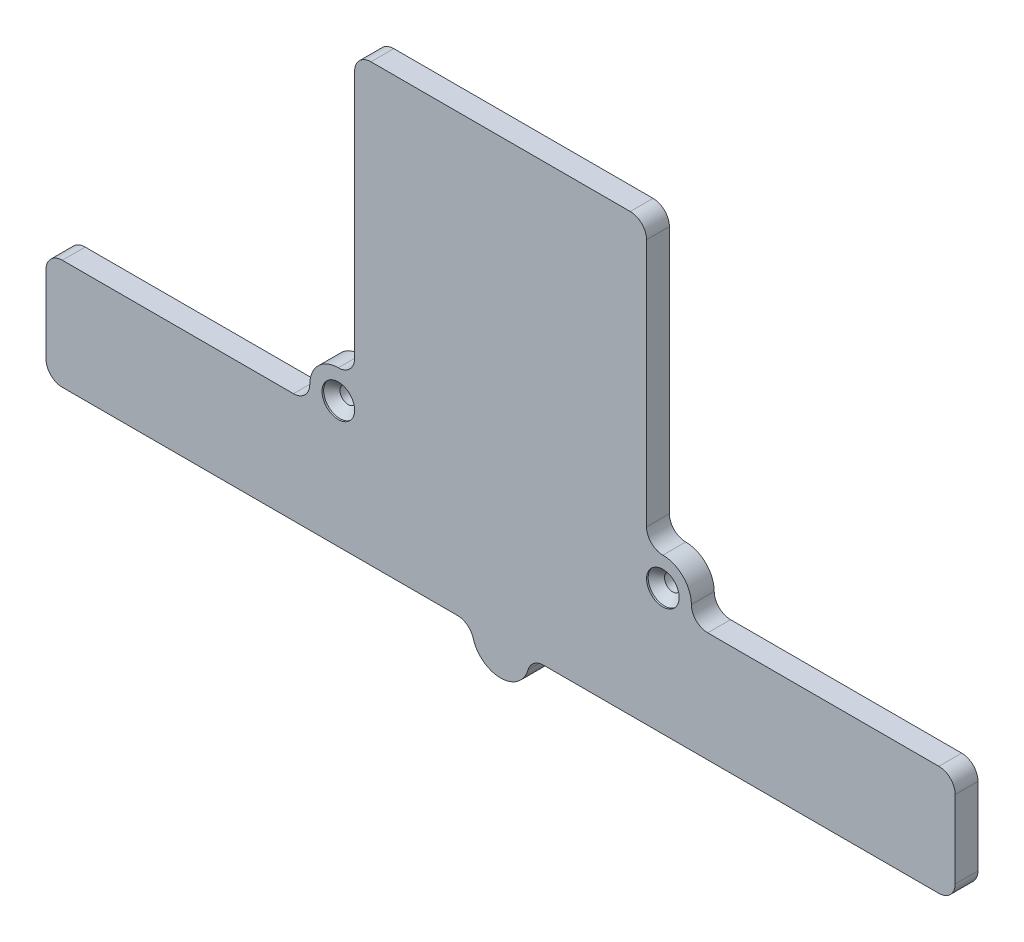
ISO-10303-21;
HEADER;
FILE_DESCRIPTION(('STEP AP214'),'2;1');
FILE_NAME('part.step','',(''),(''),'','','');
FILE_SCHEMA(('AUTOMOTIVE_DESIGN { 1 0 10303 214 1 1 1 1 }'));
ENDSEC;
DATA;
#1=APPLICATION_CONTEXT('core data for automotive mechanical design processes');
#2=APPLICATION_PROTOCOL_DEFINITION('international standard','automotive_design',2000,#1);
#3=PRODUCT_CONTEXT('',#1,'mechanical');
#4=PRODUCT('Part','Part','',(#3));
#5=PRODUCT_RELATED_PRODUCT_CATEGORY('part','',(#4));
#6=PRODUCT_DEFINITION_FORMATION('','',#4);
#7=PRODUCT_DEFINITION_CONTEXT('part definition',#1,'design');
#8=PRODUCT_DEFINITION('design','',#6,#7);
#9=PRODUCT_DEFINITION_SHAPE('','',#8);
#10=(LENGTH_UNIT() NAMED_UNIT(*) SI_UNIT(.MILLI.,.METRE.));
#11=(NAMED_UNIT(*) PLANE_ANGLE_UNIT() SI_UNIT($,.RADIAN.));
#12=(NAMED_UNIT(*) SI_UNIT($,.STERADIAN.) SOLID_ANGLE_UNIT());
#13=UNCERTAINTY_MEASURE_WITH_UNIT(LENGTH_MEASURE(1.E-05),#10,'distance_accuracy_value','');
#14=(GEOMETRIC_REPRESENTATION_CONTEXT(3) GLOBAL_UNCERTAINTY_ASSIGNED_CONTEXT((#13)) GLOBAL_UNIT_ASSIGNED_CONTEXT((#10,
#11,#12)) REPRESENTATION_CONTEXT('',''));
#15=CARTESIAN_POINT('',(0.,0.,0.));
#16=DIRECTION('',(0.,0.,1.));
#17=DIRECTION('',(1.,0.,0.));
#18=AXIS2_PLACEMENT_3D('',#15,#16,#17);
#19=CARTESIAN_POINT('',(-53.75,-24.75,2.8));
#20=DIRECTION('',(0.,0.,-1.));
#21=DIRECTION('',(-1.,0.,0.));
#22=AXIS2_PLACEMENT_3D('',#19,#20,#21);
#23=CYLINDRICAL_SURFACE('',#22,2.);
#24=CARTESIAN_POINT('',(-53.75,-24.75,0.));
#25=DIRECTION('',(0.,0.,1.));
#26=DIRECTION('',(1.,0.,0.));
#27=AXIS2_PLACEMENT_3D('',#24,#25,#26);
#28=CIRCLE('',#27,2.);
#29=CARTESIAN_POINT('',(-55.75,-24.75,0.));
#30=VERTEX_POINT('',#29);
#31=CARTESIAN_POINT('',(-53.75,-26.75,0.));
#32=VERTEX_POINT('',#31);
#33=EDGE_CURVE('E238',#30,#32,#28,.T.);
#34=ORIENTED_EDGE('',*,*,#33,.T.);
#35=DIRECTION('',(0.,0.,-1.));
#36=VECTOR('',#35,1.);
#37=CARTESIAN_POINT('',(-53.75,-26.75,2.8));
#38=LINE('',#37,#36);
#39=CARTESIAN_POINT('',(-53.75,-26.75,2.8));
#40=VERTEX_POINT('',#39);
#41=EDGE_CURVE('E12',#40,#32,#38,.T.);
#42=ORIENTED_EDGE('',*,*,#41,.F.);
#43=CARTESIAN_POINT('',(-53.75,-24.75,2.8));
#44=DIRECTION('',(0.,0.,1.));
#45=DIRECTION('',(1.,0.,0.));
#46=AXIS2_PLACEMENT_3D('',#43,#44,#45);
#47=CIRCLE('',#46,2.);
#48=CARTESIAN_POINT('',(-55.75,-24.75,2.8));
#49=VERTEX_POINT('',#48);
#50=EDGE_CURVE('E287',#49,#40,#47,.T.);
#51=ORIENTED_EDGE('',*,*,#50,.F.);
#52=DIRECTION('',(0.,0.,-1.));
#53=VECTOR('',#52,1.);
#54=CARTESIAN_POINT('',(-55.75,-24.75,2.8));
#55=LINE('',#54,#53);
#56=EDGE_CURVE('E234',#49,#30,#55,.T.);
#57=ORIENTED_EDGE('',*,*,#56,.T.);
#58=EDGE_LOOP('',(#34,#42,#51,#57));
#59=FACE_BOUND('',#58,.T.);
#60=ADVANCED_FACE('F45',(#59),#23,.T.);
#61=CARTESIAN_POINT('',(-53.75,-26.75,2.8));
#62=DIRECTION('',(0.,1.,0.));
#63=DIRECTION('',(0.,0.,1.));
#64=AXIS2_PLACEMENT_3D('',#61,#62,#63);
#65=PLANE('',#64);
#66=DIRECTION('',(1.,0.,0.));
#67=VECTOR('',#66,1.);
#68=CARTESIAN_POINT('',(-53.75,-26.75,0.));
#69=LINE('',#68,#67);
#70=CARTESIAN_POINT('',(-5.29150262212917,-26.75,0.));
#71=VERTEX_POINT('',#70);
#72=EDGE_CURVE('E240',#32,#71,#69,.T.);
#73=ORIENTED_EDGE('',*,*,#72,.T.);
#74=DIRECTION('',(0.,0.,-1.));
#75=VECTOR('',#74,1.);
#76=CARTESIAN_POINT('',(-5.29150262212917,-26.75,2.8));
#77=LINE('',#76,#75);
#78=CARTESIAN_POINT('',(-5.29150262212917,-26.75,2.8));
#79=VERTEX_POINT('',#78);
#80=EDGE_CURVE('E53',#79,#71,#77,.T.);
#81=ORIENTED_EDGE('',*,*,#80,.F.);
#82=DIRECTION('',(1.,0.,0.));
#83=VECTOR('',#82,1.);
#84=CARTESIAN_POINT('',(-53.75,-26.75,2.8));
#85=LINE('',#84,#83);
#86=EDGE_CURVE('E152',#40,#79,#85,.T.);
#87=ORIENTED_EDGE('',*,*,#86,.F.);
#88=ORIENTED_EDGE('',*,*,#41,.T.);
#89=EDGE_LOOP('',(#73,#81,#87,#88));
#90=FACE_BOUND('',#89,.T.);
#91=ADVANCED_FACE('F426',(#90),#65,.F.);
#92=CARTESIAN_POINT('',(-5.29150262212917,-28.75,2.8));
#93=DIRECTION('',(0.,0.,-1.));
#94=DIRECTION('',(-1.,0.,0.));
#95=AXIS2_PLACEMENT_3D('',#92,#93,#94);
#96=CYLINDRICAL_SURFACE('',#95,2.);
#97=CARTESIAN_POINT('',(-5.29150262212917,-28.75,0.));
#98=DIRECTION('',(0.,0.,-1.));
#99=DIRECTION('',(1.,0.,0.));
#100=AXIS2_PLACEMENT_3D('',#97,#98,#99);
#101=CIRCLE('',#100,2.);
#102=CARTESIAN_POINT('',(-3.36731985044583,-28.2045454545455,0.));
#103=VERTEX_POINT('',#102);
#104=EDGE_CURVE('E245',#71,#103,#101,.T.);
#105=ORIENTED_EDGE('',*,*,#104,.T.);
#106=DIRECTION('',(0.,0.,-1.));
#107=VECTOR('',#106,1.);
#108=CARTESIAN_POINT('',(-3.36731985044583,-28.2045454545455,2.8));
#109=LINE('',#108,#107);
#110=CARTESIAN_POINT('',(-3.36731985044583,-28.2045454545455,2.8));
#111=VERTEX_POINT('',#110);
#112=EDGE_CURVE('E342',#111,#103,#109,.T.);
#113=ORIENTED_EDGE('',*,*,#112,.F.);
#114=CARTESIAN_POINT('',(-5.29150262212917,-28.75,2.8));
#115=DIRECTION('',(0.,0.,-1.));
#116=DIRECTION('',(1.,0.,0.));
#117=AXIS2_PLACEMENT_3D('',#114,#115,#116);
#118=CIRCLE('',#117,2.);
#119=EDGE_CURVE('E350',#79,#111,#118,.T.);
#120=ORIENTED_EDGE('',*,*,#119,.F.);
#121=ORIENTED_EDGE('',*,*,#80,.T.);
#122=EDGE_LOOP('',(#105,#113,#120,#121));
#123=FACE_BOUND('',#122,.T.);
#124=ADVANCED_FACE('F348',(#123),#96,.F.);
#125=CARTESIAN_POINT('',(0.,-27.25,2.8));
#126=DIRECTION('',(0.,0.,-1.));
#127=DIRECTION('',(-1.,0.,0.));
#128=AXIS2_PLACEMENT_3D('',#125,#126,#127);
#129=CYLINDRICAL_SURFACE('',#128,3.5);
#130=CARTESIAN_POINT('',(0.,-27.25,0.));
#131=DIRECTION('',(0.,0.,1.));
#132=DIRECTION('',(1.,0.,0.));
#133=AXIS2_PLACEMENT_3D('',#130,#131,#132);
#134=CIRCLE('',#133,3.5);
#135=CARTESIAN_POINT('',(3.36731985044585,-28.2045454545455,0.));
#136=VERTEX_POINT('',#135);
#137=EDGE_CURVE('E248',#103,#136,#134,.T.);
#138=ORIENTED_EDGE('',*,*,#137,.T.);
#139=DIRECTION('',(0.,0.,-1.));
#140=VECTOR('',#139,1.);
#141=CARTESIAN_POINT('',(3.36731985044585,-28.2045454545455,2.8));
#142=LINE('',#141,#140);
#143=CARTESIAN_POINT('',(3.36731985044585,-28.2045454545455,2.8));
#144=VERTEX_POINT('',#143);
#145=EDGE_CURVE('E339',#144,#136,#142,.T.);
#146=ORIENTED_EDGE('',*,*,#145,.F.);
#147=CARTESIAN_POINT('',(0.,-27.25,2.8));
#148=DIRECTION('',(0.,0.,1.));
#149=DIRECTION('',(1.,0.,0.));
#150=AXIS2_PLACEMENT_3D('',#147,#148,#149);
#151=CIRCLE('',#150,3.5);
#152=EDGE_CURVE('E368',#111,#144,#151,.T.);
#153=ORIENTED_EDGE('',*,*,#152,.F.);
#154=ORIENTED_EDGE('',*,*,#112,.T.);
#155=EDGE_LOOP('',(#138,#146,#153,#154));
#156=FACE_BOUND('',#155,.T.);
#157=ADVANCED_FACE('F359',(#156),#129,.T.);
#158=CARTESIAN_POINT('',(5.29150262212919,-28.75,2.8));
#159=DIRECTION('',(0.,0.,-1.));
#160=DIRECTION('',(-1.,0.,0.));
#161=AXIS2_PLACEMENT_3D('',#158,#159,#160);
#162=CYLINDRICAL_SURFACE('',#161,2.);
#163=CARTESIAN_POINT('',(5.29150262212919,-28.75,0.));
#164=DIRECTION('',(0.,0.,-1.));
#165=DIRECTION('',(1.,0.,0.));
#166=AXIS2_PLACEMENT_3D('',#163,#164,#165);
#167=CIRCLE('',#166,2.);
#168=CARTESIAN_POINT('',(5.29150262212919,-26.75,0.));
#169=VERTEX_POINT('',#168);
#170=EDGE_CURVE('E250',#136,#169,#167,.T.);
#171=ORIENTED_EDGE('',*,*,#170,.T.);
#172=DIRECTION('',(0.,0.,-1.));
#173=VECTOR('',#172,1.);
#174=CARTESIAN_POINT('',(5.29150262212919,-26.75,2.8));
#175=LINE('',#174,#173);
#176=CARTESIAN_POINT('',(5.29150262212919,-26.75,2.8));
#177=VERTEX_POINT('',#176);
#178=EDGE_CURVE('E336',#177,#169,#175,.T.);
#179=ORIENTED_EDGE('',*,*,#178,.F.);
#180=CARTESIAN_POINT('',(5.29150262212919,-28.75,2.8));
#181=DIRECTION('',(0.,0.,-1.));
#182=DIRECTION('',(1.,0.,0.));
#183=AXIS2_PLACEMENT_3D('',#180,#181,#182);
#184=CIRCLE('',#183,2.);
#185=EDGE_CURVE('E365',#144,#177,#184,.T.);
#186=ORIENTED_EDGE('',*,*,#185,.F.);
#187=ORIENTED_EDGE('',*,*,#145,.T.);
#188=EDGE_LOOP('',(#171,#179,#186,#187));
#189=FACE_BOUND('',#188,.T.);
#190=ADVANCED_FACE('F363',(#189),#162,.F.);
#191=CARTESIAN_POINT('',(5.29150262212919,-26.75,2.8));
#192=DIRECTION('',(0.,1.,0.));
#193=DIRECTION('',(0.,0.,1.));
#194=AXIS2_PLACEMENT_3D('',#191,#192,#193);
#195=PLANE('',#194);
#196=DIRECTION('',(1.,0.,0.));
#197=VECTOR('',#196,1.);
#198=CARTESIAN_POINT('',(5.29150262212919,-26.75,0.));
#199=LINE('',#198,#197);
#200=CARTESIAN_POINT('',(53.75,-26.75,0.));
#201=VERTEX_POINT('',#200);
#202=EDGE_CURVE('E252',#169,#201,#199,.T.);
#203=ORIENTED_EDGE('',*,*,#202,.T.);
#204=DIRECTION('',(0.,0.,-1.));
#205=VECTOR('',#204,1.);
#206=CARTESIAN_POINT('',(53.75,-26.75,2.8));
#207=LINE('',#206,#205);
#208=CARTESIAN_POINT('',(53.75,-26.75,2.8));
#209=VERTEX_POINT('',#208);
#210=EDGE_CURVE('E333',#209,#201,#207,.T.);
#211=ORIENTED_EDGE('',*,*,#210,.F.);
#212=DIRECTION('',(1.,0.,0.));
#213=VECTOR('',#212,1.);
#214=CARTESIAN_POINT('',(5.29150262212919,-26.75,2.8));
#215=LINE('',#214,#213);
#216=EDGE_CURVE('E367',#177,#209,#215,.T.);
#217=ORIENTED_EDGE('',*,*,#216,.F.);
#218=ORIENTED_EDGE('',*,*,#178,.T.);
#219=EDGE_LOOP('',(#203,#211,#217,#218));
#220=FACE_BOUND('',#219,.T.);
#221=ADVANCED_FACE('F440',(#220),#195,.F.);
#222=CARTESIAN_POINT('',(53.75,-24.75,2.8));
#223=DIRECTION('',(0.,0.,-1.));
#224=DIRECTION('',(-1.,0.,0.));
#225=AXIS2_PLACEMENT_3D('',#222,#223,#224);
#226=CYLINDRICAL_SURFACE('',#225,2.);
#227=CARTESIAN_POINT('',(53.75,-24.75,0.));
#228=DIRECTION('',(0.,0.,1.));
#229=DIRECTION('',(1.,0.,0.));
#230=AXIS2_PLACEMENT_3D('',#227,#228,#229);
#231=CIRCLE('',#230,2.);
#232=CARTESIAN_POINT('',(55.75,-24.75,0.));
#233=VERTEX_POINT('',#232);
#234=EDGE_CURVE('E254',#201,#233,#231,.T.);
#235=ORIENTED_EDGE('',*,*,#234,.T.);
#236=DIRECTION('',(0.,0.,-1.));
#237=VECTOR('',#236,1.);
#238=CARTESIAN_POINT('',(55.75,-24.75,2.8));
#239=LINE('',#238,#237);
#240=CARTESIAN_POINT('',(55.75,-24.75,2.8));
#241=VERTEX_POINT('',#240);
#242=EDGE_CURVE('E330',#241,#233,#239,.T.);
#243=ORIENTED_EDGE('',*,*,#242,.F.);
#244=CARTESIAN_POINT('',(53.75,-24.75,2.8));
#245=DIRECTION('',(0.,0.,1.));
#246=DIRECTION('',(1.,0.,0.));
#247=AXIS2_PLACEMENT_3D('',#244,#245,#246);
#248=CIRCLE('',#247,2.);
#249=EDGE_CURVE('E370',#209,#241,#248,.T.);
#250=ORIENTED_EDGE('',*,*,#249,.F.);
#251=ORIENTED_EDGE('',*,*,#210,.T.);
#252=EDGE_LOOP('',(#235,#243,#250,#251));
#253=FACE_BOUND('',#252,.T.);
#254=ADVANCED_FACE('F443',(#253),#226,.T.);
#255=CARTESIAN_POINT('',(55.75,-24.75,2.8));
#256=DIRECTION('',(-1.,0.,0.));
#257=DIRECTION('',(0.,0.,1.));
#258=AXIS2_PLACEMENT_3D('',#255,#256,#257);
#259=PLANE('',#258);
#260=DIRECTION('',(0.,1.,0.));
#261=VECTOR('',#260,1.);
#262=CARTESIAN_POINT('',(55.75,-24.75,0.));
#263=LINE('',#262,#261);
#264=CARTESIAN_POINT('',(55.75,-15.25,0.));
#265=VERTEX_POINT('',#264);
#266=EDGE_CURVE('E256',#233,#265,#263,.T.);
#267=ORIENTED_EDGE('',*,*,#266,.T.);
#268=DIRECTION('',(0.,0.,-1.));
#269=VECTOR('',#268,1.);
#270=CARTESIAN_POINT('',(55.75,-15.25,2.8));
#271=LINE('',#270,#269);
#272=CARTESIAN_POINT('',(55.75,-15.25,2.8));
#273=VERTEX_POINT('',#272);
#274=EDGE_CURVE('E327',#273,#265,#271,.T.);
#275=ORIENTED_EDGE('',*,*,#274,.F.);
#276=DIRECTION('',(0.,1.,0.));
#277=VECTOR('',#276,1.);
#278=CARTESIAN_POINT('',(55.75,-24.75,2.8));
#279=LINE('',#278,#277);
#280=EDGE_CURVE('E376',#241,#273,#279,.T.);
#281=ORIENTED_EDGE('',*,*,#280,.F.);
#282=ORIENTED_EDGE('',*,*,#242,.T.);
#283=EDGE_LOOP('',(#267,#275,#281,#282));
#284=FACE_BOUND('',#283,.T.);
#285=ADVANCED_FACE('F447',(#284),#259,.F.);
#286=CARTESIAN_POINT('',(53.75,-15.25,2.8));
#287=DIRECTION('',(0.,0.,-1.));
#288=DIRECTION('',(-1.,0.,0.));
#289=AXIS2_PLACEMENT_3D('',#286,#287,#288);
#290=CYLINDRICAL_SURFACE('',#289,2.);
#291=CARTESIAN_POINT('',(53.75,-15.25,0.));
#292=DIRECTION('',(0.,0.,1.));
#293=DIRECTION('',(1.,0.,0.));
#294=AXIS2_PLACEMENT_3D('',#291,#292,#293);
#295=CIRCLE('',#294,2.);
#296=CARTESIAN_POINT('',(53.75,-13.25,0.));
#297=VERTEX_POINT('',#296);
#298=EDGE_CURVE('E258',#265,#297,#295,.T.);
#299=ORIENTED_EDGE('',*,*,#298,.T.);
#300=DIRECTION('',(0.,0.,-1.));
#301=VECTOR('',#300,1.);
#302=CARTESIAN_POINT('',(53.75,-13.25,2.8));
#303=LINE('',#302,#301);
#304=CARTESIAN_POINT('',(53.75,-13.25,2.8));
#305=VERTEX_POINT('',#304);
#306=EDGE_CURVE('E324',#305,#297,#303,.T.);
#307=ORIENTED_EDGE('',*,*,#306,.F.);
#308=CARTESIAN_POINT('',(53.75,-15.25,2.8));
#309=DIRECTION('',(0.,0.,1.));
#310=DIRECTION('',(1.,0.,0.));
#311=AXIS2_PLACEMENT_3D('',#308,#309,#310);
#312=CIRCLE('',#311,2.);
#313=EDGE_CURVE('E378',#273,#305,#312,.T.);
#314=ORIENTED_EDGE('',*,*,#313,.F.);
#315=ORIENTED_EDGE('',*,*,#274,.T.);
#316=EDGE_LOOP('',(#299,#307,#314,#315));
#317=FACE_BOUND('',#316,.T.);
#318=ADVANCED_FACE('F451',(#317),#290,.T.);
#319=CARTESIAN_POINT('',(53.75,-13.25,2.8));
#320=DIRECTION('',(0.,-1.,0.));
#321=DIRECTION('',(1.,0.,0.));
#322=AXIS2_PLACEMENT_3D('',#319,#320,#321);
#323=PLANE('',#322);
#324=DIRECTION('',(-1.,0.,0.));
#325=VECTOR('',#324,1.);
#326=CARTESIAN_POINT('',(53.75,-13.25,0.));
#327=LINE('',#326,#325);
#328=CARTESIAN_POINT('',(25.4,-13.25,0.));
#329=VERTEX_POINT('',#328);
#330=EDGE_CURVE('E260',#297,#329,#327,.T.);
#331=ORIENTED_EDGE('',*,*,#330,.T.);
#332=DIRECTION('',(0.,0.,-1.));
#333=VECTOR('',#332,1.);
#334=CARTESIAN_POINT('',(25.4,-13.25,2.8));
#335=LINE('',#334,#333);
#336=CARTESIAN_POINT('',(25.4,-13.25,2.8));
#337=VERTEX_POINT('',#336);
#338=EDGE_CURVE('E321',#337,#329,#335,.T.);
#339=ORIENTED_EDGE('',*,*,#338,.F.);
#340=DIRECTION('',(-1.,0.,0.));
#341=VECTOR('',#340,1.);
#342=CARTESIAN_POINT('',(53.75,-13.25,2.8));
#343=LINE('',#342,#341);
#344=EDGE_CURVE('E380',#305,#337,#343,.T.);
#345=ORIENTED_EDGE('',*,*,#344,.F.);
#346=ORIENTED_EDGE('',*,*,#306,.T.);
#347=EDGE_LOOP('',(#331,#339,#345,#346));
#348=FACE_BOUND('',#347,.T.);
#349=ADVANCED_FACE('F455',(#348),#323,.F.);
#350=CARTESIAN_POINT('',(25.4,-11.25,2.8));
#351=DIRECTION('',(0.,0.,-1.));
#352=DIRECTION('',(-1.,0.,0.));
#353=AXIS2_PLACEMENT_3D('',#350,#351,#352);
#354=CYLINDRICAL_SURFACE('',#353,2.);
#355=CARTESIAN_POINT('',(25.4,-11.25,0.));
#356=DIRECTION('',(0.,0.,-1.));
#357=DIRECTION('',(1.,0.,0.));
#358=AXIS2_PLACEMENT_3D('',#355,#356,#357);
#359=CIRCLE('',#358,2.);
#360=CARTESIAN_POINT('',(23.4,-11.25,0.));
#361=VERTEX_POINT('',#360);
#362=EDGE_CURVE('E262',#329,#361,#359,.T.);
#363=ORIENTED_EDGE('',*,*,#362,.T.);
#364=DIRECTION('',(0.,0.,-1.));
#365=VECTOR('',#364,1.);
#366=CARTESIAN_POINT('',(23.4,-11.25,2.8));
#367=LINE('',#366,#365);
#368=CARTESIAN_POINT('',(23.4,-11.25,2.8));
#369=VERTEX_POINT('',#368);
#370=EDGE_CURVE('E318',#369,#361,#367,.T.);
#371=ORIENTED_EDGE('',*,*,#370,.F.);
#372=CARTESIAN_POINT('',(25.4,-11.25,2.8));
#373=DIRECTION('',(0.,0.,-1.));
#374=DIRECTION('',(1.,0.,0.));
#375=AXIS2_PLACEMENT_3D('',#372,#373,#374);
#376=CIRCLE('',#375,2.);
#377=EDGE_CURVE('E382',#337,#369,#376,.T.);
#378=ORIENTED_EDGE('',*,*,#377,.F.);
#379=ORIENTED_EDGE('',*,*,#338,.T.);
#380=EDGE_LOOP('',(#363,#371,#378,#379));
#381=FACE_BOUND('',#380,.T.);
#382=ADVANCED_FACE('F459',(#381),#354,.F.);
#383=CARTESIAN_POINT('',(19.9,-11.25,2.8));
#384=DIRECTION('',(0.,0.,-1.));
#385=DIRECTION('',(-1.,0.,0.));
#386=AXIS2_PLACEMENT_3D('',#383,#384,#385);
#387=CYLINDRICAL_SURFACE('',#386,3.50000000000001);
#388=CARTESIAN_POINT('',(19.9,-11.25,0.));
#389=DIRECTION('',(0.,0.,1.));
#390=DIRECTION('',(1.,0.,0.));
#391=AXIS2_PLACEMENT_3D('',#388,#389,#390);
#392=CIRCLE('',#391,3.50000000000001);
#393=CARTESIAN_POINT('',(19.9,-7.74999999999999,0.));
#394=VERTEX_POINT('',#393);
#395=EDGE_CURVE('E264',#361,#394,#392,.T.);
#396=ORIENTED_EDGE('',*,*,#395,.T.);
#397=DIRECTION('',(0.,0.,-1.));
#398=VECTOR('',#397,1.);
#399=CARTESIAN_POINT('',(19.9,-7.74999999999999,2.8));
#400=LINE('',#399,#398);
#401=CARTESIAN_POINT('',(19.9,-7.74999999999999,2.8));
#402=VERTEX_POINT('',#401);
#403=EDGE_CURVE('E315',#402,#394,#400,.T.);
#404=ORIENTED_EDGE('',*,*,#403,.F.);
#405=CARTESIAN_POINT('',(19.9,-11.25,2.8));
#406=DIRECTION('',(0.,0.,1.));
#407=DIRECTION('',(1.,0.,0.));
#408=AXIS2_PLACEMENT_3D('',#405,#406,#407);
#409=CIRCLE('',#408,3.50000000000001);
#410=EDGE_CURVE('E384',#369,#402,#409,.T.);
#411=ORIENTED_EDGE('',*,*,#410,.F.);
#412=ORIENTED_EDGE('',*,*,#370,.T.);
#413=EDGE_LOOP('',(#396,#404,#411,#412));
#414=FACE_BOUND('',#413,.T.);
#415=ADVANCED_FACE('F463',(#414),#387,.T.);
#416=CARTESIAN_POINT('',(19.9,-5.75,2.8));
#417=DIRECTION('',(0.,0.,-1.));
#418=DIRECTION('',(-1.,0.,0.));
#419=AXIS2_PLACEMENT_3D('',#416,#417,#418);
#420=CYLINDRICAL_SURFACE('',#419,2.);
#421=CARTESIAN_POINT('',(19.9,-5.75,0.));
#422=DIRECTION('',(0.,0.,-1.));
#423=DIRECTION('',(1.,0.,0.));
#424=AXIS2_PLACEMENT_3D('',#421,#422,#423);
#425=CIRCLE('',#424,2.);
#426=CARTESIAN_POINT('',(17.9,-5.75000000000001,0.));
#427=VERTEX_POINT('',#426);
#428=EDGE_CURVE('E266',#394,#427,#425,.T.);
#429=ORIENTED_EDGE('',*,*,#428,.T.);
#430=DIRECTION('',(0.,0.,-1.));
#431=VECTOR('',#430,1.);
#432=CARTESIAN_POINT('',(17.9,-5.75000000000001,2.8));
#433=LINE('',#432,#431);
#434=CARTESIAN_POINT('',(17.9,-5.75000000000001,2.8));
#435=VERTEX_POINT('',#434);
#436=EDGE_CURVE('E312',#435,#427,#433,.T.);
#437=ORIENTED_EDGE('',*,*,#436,.F.);
#438=CARTESIAN_POINT('',(19.9,-5.75,2.8));
#439=DIRECTION('',(0.,0.,-1.));
#440=DIRECTION('',(1.,0.,0.));
#441=AXIS2_PLACEMENT_3D('',#438,#439,#440);
#442=CIRCLE('',#441,2.);
#443=EDGE_CURVE('E386',#402,#435,#442,.T.);
#444=ORIENTED_EDGE('',*,*,#443,.F.);
#445=ORIENTED_EDGE('',*,*,#403,.T.);
#446=EDGE_LOOP('',(#429,#437,#444,#445));
#447=FACE_BOUND('',#446,.T.);
#448=ADVANCED_FACE('F467',(#447),#420,.F.);
#449=CARTESIAN_POINT('',(17.9,-5.75000000000001,2.8));
#450=DIRECTION('',(-1.,0.,0.));
#451=DIRECTION('',(0.,0.,1.));
#452=AXIS2_PLACEMENT_3D('',#449,#450,#451);
#453=PLANE('',#452);
#454=DIRECTION('',(0.,1.,0.));
#455=VECTOR('',#454,1.);
#456=CARTESIAN_POINT('',(17.9,-5.75000000000001,0.));
#457=LINE('',#456,#455);
#458=CARTESIAN_POINT('',(17.9,24.75,0.));
#459=VERTEX_POINT('',#458);
#460=EDGE_CURVE('E268',#427,#459,#457,.T.);
#461=ORIENTED_EDGE('',*,*,#460,.T.);
#462=DIRECTION('',(0.,0.,-1.));
#463=VECTOR('',#462,1.);
#464=CARTESIAN_POINT('',(17.9,24.75,2.8));
#465=LINE('',#464,#463);
#466=CARTESIAN_POINT('',(17.9,24.75,2.8));
#467=VERTEX_POINT('',#466);
#468=EDGE_CURVE('E309',#467,#459,#465,.T.);
#469=ORIENTED_EDGE('',*,*,#468,.F.);
#470=DIRECTION('',(0.,1.,0.));
#471=VECTOR('',#470,1.);
#472=CARTESIAN_POINT('',(17.9,-5.75000000000001,2.8));
#473=LINE('',#472,#471);
#474=EDGE_CURVE('E388',#435,#467,#473,.T.);
#475=ORIENTED_EDGE('',*,*,#474,.F.);
#476=ORIENTED_EDGE('',*,*,#436,.T.);
#477=EDGE_LOOP('',(#461,#469,#475,#476));
#478=FACE_BOUND('',#477,.T.);
#479=ADVANCED_FACE('F471',(#478),#453,.F.);
#480=CARTESIAN_POINT('',(15.9,24.75,2.8));
#481=DIRECTION('',(0.,0.,-1.));
#482=DIRECTION('',(-1.,0.,0.));
#483=AXIS2_PLACEMENT_3D('',#480,#481,#482);
#484=CYLINDRICAL_SURFACE('',#483,2.);
#485=CARTESIAN_POINT('',(15.9,24.75,0.));
#486=DIRECTION('',(0.,0.,1.));
#487=DIRECTION('',(1.,0.,0.));
#488=AXIS2_PLACEMENT_3D('',#485,#486,#487);
#489=CIRCLE('',#488,2.);
#490=CARTESIAN_POINT('',(15.9,26.75,0.));
#491=VERTEX_POINT('',#490);
#492=EDGE_CURVE('E270',#459,#491,#489,.T.);
#493=ORIENTED_EDGE('',*,*,#492,.T.);
#494=DIRECTION('',(0.,0.,-1.));
#495=VECTOR('',#494,1.);
#496=CARTESIAN_POINT('',(15.9,26.75,2.8));
#497=LINE('',#496,#495);
#498=CARTESIAN_POINT('',(15.9,26.75,2.8));
#499=VERTEX_POINT('',#498);
#500=EDGE_CURVE('E306',#499,#491,#497,.T.);
#501=ORIENTED_EDGE('',*,*,#500,.F.);
#502=CARTESIAN_POINT('',(15.9,24.75,2.8));
#503=DIRECTION('',(0.,0.,1.));
#504=DIRECTION('',(1.,0.,0.));
#505=AXIS2_PLACEMENT_3D('',#502,#503,#504);
#506=CIRCLE('',#505,2.);
#507=EDGE_CURVE('E390',#467,#499,#506,.T.);
#508=ORIENTED_EDGE('',*,*,#507,.F.);
#509=ORIENTED_EDGE('',*,*,#468,.T.);
#510=EDGE_LOOP('',(#493,#501,#508,#509));
#511=FACE_BOUND('',#510,.T.);
#512=ADVANCED_FACE('F475',(#511),#484,.T.);
#513=CARTESIAN_POINT('',(15.9,26.75,2.8));
#514=DIRECTION('',(0.,-1.,0.));
#515=DIRECTION('',(0.,0.,-1.));
#516=AXIS2_PLACEMENT_3D('',#513,#514,#515);
#517=PLANE('',#516);
#518=DIRECTION('',(-1.,0.,0.));
#519=VECTOR('',#518,1.);
#520=CARTESIAN_POINT('',(15.9,26.75,0.));
#521=LINE('',#520,#519);
#522=CARTESIAN_POINT('',(-15.9,26.75,0.));
#523=VERTEX_POINT('',#522);
#524=EDGE_CURVE('E272',#491,#523,#521,.T.);
#525=ORIENTED_EDGE('',*,*,#524,.T.);
#526=DIRECTION('',(0.,0.,-1.));
#527=VECTOR('',#526,1.);
#528=CARTESIAN_POINT('',(-15.9,26.75,2.8));
#529=LINE('',#528,#527);
#530=CARTESIAN_POINT('',(-15.9,26.75,2.8));
#531=VERTEX_POINT('',#530);
#532=EDGE_CURVE('E303',#531,#523,#529,.T.);
#533=ORIENTED_EDGE('',*,*,#532,.F.);
#534=DIRECTION('',(-1.,0.,0.));
#535=VECTOR('',#534,1.);
#536=CARTESIAN_POINT('',(15.9,26.75,2.8));
#537=LINE('',#536,#535);
#538=EDGE_CURVE('E392',#499,#531,#537,.T.);
#539=ORIENTED_EDGE('',*,*,#538,.F.);
#540=ORIENTED_EDGE('',*,*,#500,.T.);
#541=EDGE_LOOP('',(#525,#533,#539,#540));
#542=FACE_BOUND('',#541,.T.);
#543=ADVANCED_FACE('F479',(#542),#517,.F.);
#544=CARTESIAN_POINT('',(-15.9,24.75,2.8));
#545=DIRECTION('',(0.,0.,-1.));
#546=DIRECTION('',(-1.,0.,0.));
#547=AXIS2_PLACEMENT_3D('',#544,#545,#546);
#548=CYLINDRICAL_SURFACE('',#547,2.);
#549=CARTESIAN_POINT('',(-15.9,24.75,0.));
#550=DIRECTION('',(0.,0.,1.));
#551=DIRECTION('',(1.,0.,0.));
#552=AXIS2_PLACEMENT_3D('',#549,#550,#551);
#553=CIRCLE('',#552,2.);
#554=CARTESIAN_POINT('',(-17.9,24.75,0.));
#555=VERTEX_POINT('',#554);
#556=EDGE_CURVE('E274',#523,#555,#553,.T.);
#557=ORIENTED_EDGE('',*,*,#556,.T.);
#558=DIRECTION('',(0.,0.,-1.));
#559=VECTOR('',#558,1.);
#560=CARTESIAN_POINT('',(-17.9,24.75,2.8));
#561=LINE('',#560,#559);
#562=CARTESIAN_POINT('',(-17.9,24.75,2.8));
#563=VERTEX_POINT('',#562);
#564=EDGE_CURVE('E300',#563,#555,#561,.T.);
#565=ORIENTED_EDGE('',*,*,#564,.F.);
#566=CARTESIAN_POINT('',(-15.9,24.75,2.8));
#567=DIRECTION('',(0.,0.,1.));
#568=DIRECTION('',(1.,0.,0.));
#569=AXIS2_PLACEMENT_3D('',#566,#567,#568);
#570=CIRCLE('',#569,2.);
#571=EDGE_CURVE('E394',#531,#563,#570,.T.);
#572=ORIENTED_EDGE('',*,*,#571,.F.);
#573=ORIENTED_EDGE('',*,*,#532,.T.);
#574=EDGE_LOOP('',(#557,#565,#572,#573));
#575=FACE_BOUND('',#574,.T.);
#576=ADVANCED_FACE('F483',(#575),#548,.T.);
#577=CARTESIAN_POINT('',(-17.9,24.75,2.8));
#578=DIRECTION('',(1.,0.,0.));
#579=DIRECTION('',(0.,0.,-1.));
#580=AXIS2_PLACEMENT_3D('',#577,#578,#579);
#581=PLANE('',#580);
#582=DIRECTION('',(0.,-1.,0.));
#583=VECTOR('',#582,1.);
#584=CARTESIAN_POINT('',(-17.9,24.75,0.));
#585=LINE('',#584,#583);
#586=CARTESIAN_POINT('',(-17.9,-5.75000000000001,0.));
#587=VERTEX_POINT('',#586);
#588=EDGE_CURVE('E276',#555,#587,#585,.T.);
#589=ORIENTED_EDGE('',*,*,#588,.T.);
#590=DIRECTION('',(0.,0.,-1.));
#591=VECTOR('',#590,1.);
#592=CARTESIAN_POINT('',(-17.9,-5.75000000000001,2.8));
#593=LINE('',#592,#591);
#594=CARTESIAN_POINT('',(-17.9,-5.75000000000001,2.8));
#595=VERTEX_POINT('',#594);
#596=EDGE_CURVE('E297',#595,#587,#593,.T.);
#597=ORIENTED_EDGE('',*,*,#596,.F.);
#598=DIRECTION('',(0.,-1.,0.));
#599=VECTOR('',#598,1.);
#600=CARTESIAN_POINT('',(-17.9,24.75,2.8));
#601=LINE('',#600,#599);
#602=EDGE_CURVE('E396',#563,#595,#601,.T.);
#603=ORIENTED_EDGE('',*,*,#602,.F.);
#604=ORIENTED_EDGE('',*,*,#564,.T.);
#605=EDGE_LOOP('',(#589,#597,#603,#604));
#606=FACE_BOUND('',#605,.T.);
#607=ADVANCED_FACE('F487',(#606),#581,.F.);
#608=CARTESIAN_POINT('',(-19.9,-5.75000000000001,2.8));
#609=DIRECTION('',(0.,0.,-1.));
#610=DIRECTION('',(-1.,0.,0.));
#611=AXIS2_PLACEMENT_3D('',#608,#609,#610);
#612=CYLINDRICAL_SURFACE('',#611,2.);
#613=CARTESIAN_POINT('',(-19.9,-5.75000000000001,0.));
#614=DIRECTION('',(0.,0.,-1.));
#615=DIRECTION('',(1.,0.,0.));
#616=AXIS2_PLACEMENT_3D('',#613,#614,#615);
#617=CIRCLE('',#616,2.);
#618=CARTESIAN_POINT('',(-19.9,-7.75000000000001,0.));
#619=VERTEX_POINT('',#618);
#620=EDGE_CURVE('E278',#587,#619,#617,.T.);
#621=ORIENTED_EDGE('',*,*,#620,.T.);
#622=DIRECTION('',(0.,0.,-1.));
#623=VECTOR('',#622,1.);
#624=CARTESIAN_POINT('',(-19.9,-7.75000000000001,2.8));
#625=LINE('',#624,#623);
#626=CARTESIAN_POINT('',(-19.9,-7.75000000000001,2.8));
#627=VERTEX_POINT('',#626);
#628=EDGE_CURVE('E294',#627,#619,#625,.T.);
#629=ORIENTED_EDGE('',*,*,#628,.F.);
#630=CARTESIAN_POINT('',(-19.9,-5.75000000000001,2.8));
#631=DIRECTION('',(0.,0.,-1.));
#632=DIRECTION('',(1.,0.,0.));
#633=AXIS2_PLACEMENT_3D('',#630,#631,#632);
#634=CIRCLE('',#633,2.);
#635=EDGE_CURVE('E398',#595,#627,#634,.T.);
#636=ORIENTED_EDGE('',*,*,#635,.F.);
#637=ORIENTED_EDGE('',*,*,#596,.T.);
#638=EDGE_LOOP('',(#621,#629,#636,#637));
#639=FACE_BOUND('',#638,.T.);
#640=ADVANCED_FACE('F491',(#639),#612,.F.);
#641=CARTESIAN_POINT('',(-19.9,-11.25,2.8));
#642=DIRECTION('',(0.,0.,-1.));
#643=DIRECTION('',(-1.,0.,0.));
#644=AXIS2_PLACEMENT_3D('',#641,#642,#643);
#645=CYLINDRICAL_SURFACE('',#644,3.5);
#646=CARTESIAN_POINT('',(-19.9,-11.25,0.));
#647=DIRECTION('',(0.,0.,1.));
#648=DIRECTION('',(1.,0.,0.));
#649=AXIS2_PLACEMENT_3D('',#646,#647,#648);
#650=CIRCLE('',#649,3.5);
#651=CARTESIAN_POINT('',(-23.4,-11.25,0.));
#652=VERTEX_POINT('',#651);
#653=EDGE_CURVE('E280',#619,#652,#650,.T.);
#654=ORIENTED_EDGE('',*,*,#653,.T.);
#655=DIRECTION('',(0.,0.,-1.));
#656=VECTOR('',#655,1.);
#657=CARTESIAN_POINT('',(-23.4,-11.25,2.8));
#658=LINE('',#657,#656);
#659=CARTESIAN_POINT('',(-23.4,-11.25,2.8));
#660=VERTEX_POINT('',#659);
#661=EDGE_CURVE('E291',#660,#652,#658,.T.);
#662=ORIENTED_EDGE('',*,*,#661,.F.);
#663=CARTESIAN_POINT('',(-19.9,-11.25,2.8));
#664=DIRECTION('',(0.,0.,1.));
#665=DIRECTION('',(1.,0.,0.));
#666=AXIS2_PLACEMENT_3D('',#663,#664,#665);
#667=CIRCLE('',#666,3.5);
#668=EDGE_CURVE('E400',#627,#660,#667,.T.);
#669=ORIENTED_EDGE('',*,*,#668,.F.);
#670=ORIENTED_EDGE('',*,*,#628,.T.);
#671=EDGE_LOOP('',(#654,#662,#669,#670));
#672=FACE_BOUND('',#671,.T.);
#673=ADVANCED_FACE('F406',(#672),#645,.T.);
#674=CARTESIAN_POINT('',(-25.4,-11.25,2.8));
#675=DIRECTION('',(0.,0.,-1.));
#676=DIRECTION('',(-1.,0.,0.));
#677=AXIS2_PLACEMENT_3D('',#674,#675,#676);
#678=CYLINDRICAL_SURFACE('',#677,2.);
#679=CARTESIAN_POINT('',(-25.4,-11.25,0.));
#680=DIRECTION('',(0.,0.,-1.));
#681=DIRECTION('',(1.,0.,0.));
#682=AXIS2_PLACEMENT_3D('',#679,#680,#681);
#683=CIRCLE('',#682,2.);
#684=CARTESIAN_POINT('',(-25.4,-13.25,0.));
#685=VERTEX_POINT('',#684);
#686=EDGE_CURVE('E282',#652,#685,#683,.T.);
#687=ORIENTED_EDGE('',*,*,#686,.T.);
#688=DIRECTION('',(0.,0.,-1.));
#689=VECTOR('',#688,1.);
#690=CARTESIAN_POINT('',(-25.4,-13.25,2.8));
#691=LINE('',#690,#689);
#692=CARTESIAN_POINT('',(-25.4,-13.25,2.8));
#693=VERTEX_POINT('',#692);
#694=EDGE_CURVE('E229',#693,#685,#691,.T.);
#695=ORIENTED_EDGE('',*,*,#694,.F.);
#696=CARTESIAN_POINT('',(-25.4,-11.25,2.8));
#697=DIRECTION('',(0.,0.,-1.));
#698=DIRECTION('',(1.,0.,0.));
#699=AXIS2_PLACEMENT_3D('',#696,#697,#698);
#700=CIRCLE('',#699,2.);
#701=EDGE_CURVE('E220',#660,#693,#700,.T.);
#702=ORIENTED_EDGE('',*,*,#701,.F.);
#703=ORIENTED_EDGE('',*,*,#661,.T.);
#704=EDGE_LOOP('',(#687,#695,#702,#703));
#705=FACE_BOUND('',#704,.T.);
#706=ADVANCED_FACE('F410',(#705),#678,.F.);
#707=CARTESIAN_POINT('',(-25.4,-13.25,2.8));
#708=DIRECTION('',(0.,-1.,0.));
#709=DIRECTION('',(0.,0.,-1.));
#710=AXIS2_PLACEMENT_3D('',#707,#708,#709);
#711=PLANE('',#710);
#712=DIRECTION('',(-1.,0.,0.));
#713=VECTOR('',#712,1.);
#714=CARTESIAN_POINT('',(-25.4,-13.25,0.));
#715=LINE('',#714,#713);
#716=CARTESIAN_POINT('',(-53.75,-13.25,0.));
#717=VERTEX_POINT('',#716);
#718=EDGE_CURVE('E228',#685,#717,#715,.T.);
#719=ORIENTED_EDGE('',*,*,#718,.T.);
#720=DIRECTION('',(0.,0.,-1.));
#721=VECTOR('',#720,1.);
#722=CARTESIAN_POINT('',(-53.75,-13.25,2.8));
#723=LINE('',#722,#721);
#724=CARTESIAN_POINT('',(-53.75,-13.25,2.8));
#725=VERTEX_POINT('',#724);
#726=EDGE_CURVE('E225',#725,#717,#723,.T.);
#727=ORIENTED_EDGE('',*,*,#726,.F.);
#728=DIRECTION('',(-1.,0.,0.));
#729=VECTOR('',#728,1.);
#730=CARTESIAN_POINT('',(-25.4,-13.25,2.8));
#731=LINE('',#730,#729);
#732=EDGE_CURVE('E214',#693,#725,#731,.T.);
#733=ORIENTED_EDGE('',*,*,#732,.F.);
#734=ORIENTED_EDGE('',*,*,#694,.T.);
#735=EDGE_LOOP('',(#719,#727,#733,#734));
#736=FACE_BOUND('',#735,.T.);
#737=ADVANCED_FACE('F226',(#736),#711,.F.);
#738=CARTESIAN_POINT('',(-53.75,-15.25,2.8));
#739=DIRECTION('',(0.,0.,-1.));
#740=DIRECTION('',(-1.,0.,0.));
#741=AXIS2_PLACEMENT_3D('',#738,#739,#740);
#742=CYLINDRICAL_SURFACE('',#741,2.);
#743=CARTESIAN_POINT('',(-53.75,-15.25,0.));
#744=DIRECTION('',(0.,0.,1.));
#745=DIRECTION('',(1.,0.,0.));
#746=AXIS2_PLACEMENT_3D('',#743,#744,#745);
#747=CIRCLE('',#746,2.);
#748=CARTESIAN_POINT('',(-55.75,-15.25,0.));
#749=VERTEX_POINT('',#748);
#750=EDGE_CURVE('E138',#717,#749,#747,.T.);
#751=ORIENTED_EDGE('',*,*,#750,.T.);
#752=DIRECTION('',(0.,0.,-1.));
#753=VECTOR('',#752,1.);
#754=CARTESIAN_POINT('',(-55.75,-15.25,2.8));
#755=LINE('',#754,#753);
#756=CARTESIAN_POINT('',(-55.75,-15.25,2.8));
#757=VERTEX_POINT('',#756);
#758=EDGE_CURVE('E230',#757,#749,#755,.T.);
#759=ORIENTED_EDGE('',*,*,#758,.F.);
#760=CARTESIAN_POINT('',(-53.75,-15.25,2.8));
#761=DIRECTION('',(0.,0.,1.));
#762=DIRECTION('',(1.,0.,0.));
#763=AXIS2_PLACEMENT_3D('',#760,#761,#762);
#764=CIRCLE('',#763,2.);
#765=EDGE_CURVE('E218',#725,#757,#764,.T.);
#766=ORIENTED_EDGE('',*,*,#765,.F.);
#767=ORIENTED_EDGE('',*,*,#726,.T.);
#768=EDGE_LOOP('',(#751,#759,#766,#767));
#769=FACE_BOUND('',#768,.T.);
#770=ADVANCED_FACE('F232',(#769),#742,.T.);
#771=CARTESIAN_POINT('',(-55.75,-15.25,2.8));
#772=DIRECTION('',(1.,0.,0.));
#773=DIRECTION('',(0.,0.,-1.));
#774=AXIS2_PLACEMENT_3D('',#771,#772,#773);
#775=PLANE('',#774);
#776=DIRECTION('',(0.,-1.,0.));
#777=VECTOR('',#776,1.);
#778=CARTESIAN_POINT('',(-55.75,-15.25,0.));
#779=LINE('',#778,#777);
#780=EDGE_CURVE('E144',#749,#30,#779,.T.);
#781=ORIENTED_EDGE('',*,*,#780,.T.);
#782=ORIENTED_EDGE('',*,*,#56,.F.);
#783=DIRECTION('',(0.,-1.,0.));
#784=VECTOR('',#783,1.);
#785=CARTESIAN_POINT('',(-55.75,-15.25,2.8));
#786=LINE('',#785,#784);
#787=EDGE_CURVE('E61',#757,#49,#786,.T.);
#788=ORIENTED_EDGE('',*,*,#787,.F.);
#789=ORIENTED_EDGE('',*,*,#758,.T.);
#790=EDGE_LOOP('',(#781,#782,#788,#789));
#791=FACE_BOUND('',#790,.T.);
#792=ADVANCED_FACE('F414',(#791),#775,.F.);
#793=CARTESIAN_POINT('',(-53.75,-24.75,2.8));
#794=DIRECTION('',(0.,0.,1.));
#795=DIRECTION('',(1.,0.,0.));
#796=AXIS2_PLACEMENT_3D('',#793,#794,#795);
#797=PLANE('',#796);
#798=CARTESIAN_POINT('',(-19.9,-11.25,2.8));
#799=DIRECTION('',(0.,0.,1.));
#800=DIRECTION('',(1.,0.,0.));
#801=AXIS2_PLACEMENT_3D('',#798,#799,#800);
#802=CIRCLE('',#801,2.);
#803=CARTESIAN_POINT('',(-17.9,-11.25,2.8));
#804=VERTEX_POINT('',#803);
#805=EDGE_CURVE('E730',#804,#804,#802,.T.);
#806=ORIENTED_EDGE('',*,*,#805,.F.);
#807=EDGE_LOOP('',(#806));
#808=FACE_BOUND('',#807,.T.);
#809=CARTESIAN_POINT('',(19.9,-11.25,2.8));
#810=DIRECTION('',(0.,0.,1.));
#811=DIRECTION('',(1.,0.,0.));
#812=AXIS2_PLACEMENT_3D('',#809,#810,#811);
#813=CIRCLE('',#812,2.);
#814=CARTESIAN_POINT('',(21.9,-11.25,2.8));
#815=VERTEX_POINT('',#814);
#816=EDGE_CURVE('E737',#815,#815,#813,.T.);
#817=ORIENTED_EDGE('',*,*,#816,.F.);
#818=EDGE_LOOP('',(#817));
#819=FACE_BOUND('',#818,.T.);
#820=ORIENTED_EDGE('',*,*,#50,.T.);
#821=ORIENTED_EDGE('',*,*,#86,.T.);
#822=ORIENTED_EDGE('',*,*,#119,.T.);
#823=ORIENTED_EDGE('',*,*,#152,.T.);
#824=ORIENTED_EDGE('',*,*,#185,.T.);
#825=ORIENTED_EDGE('',*,*,#216,.T.);
#826=ORIENTED_EDGE('',*,*,#249,.T.);
#827=ORIENTED_EDGE('',*,*,#280,.T.);
#828=ORIENTED_EDGE('',*,*,#313,.T.);
#829=ORIENTED_EDGE('',*,*,#344,.T.);
#830=ORIENTED_EDGE('',*,*,#377,.T.);
#831=ORIENTED_EDGE('',*,*,#410,.T.);
#832=ORIENTED_EDGE('',*,*,#443,.T.);
#833=ORIENTED_EDGE('',*,*,#474,.T.);
#834=ORIENTED_EDGE('',*,*,#507,.T.);
#835=ORIENTED_EDGE('',*,*,#538,.T.);
#836=ORIENTED_EDGE('',*,*,#571,.T.);
#837=ORIENTED_EDGE('',*,*,#602,.T.);
#838=ORIENTED_EDGE('',*,*,#635,.T.);
#839=ORIENTED_EDGE('',*,*,#668,.T.);
#840=ORIENTED_EDGE('',*,*,#701,.T.);
#841=ORIENTED_EDGE('',*,*,#732,.T.);
#842=ORIENTED_EDGE('',*,*,#765,.T.);
#843=ORIENTED_EDGE('',*,*,#787,.T.);
#844=EDGE_LOOP('',(#820,#821,#822,#823,#824,#825,#826,#827,#828,#829,#830,#831,#832,#833,#834,
#835,#836,#837,#838,#839,#840,#841,#842,#843));
#845=FACE_BOUND('',#844,.T.);
#846=ADVANCED_FACE('F216',(#808,#819,#845),#797,.T.);
#847=CARTESIAN_POINT('',(-53.75,-24.75,0.));
#848=DIRECTION('',(0.,0.,1.));
#849=DIRECTION('',(1.,0.,0.));
#850=AXIS2_PLACEMENT_3D('',#847,#848,#849);
#851=PLANE('',#850);
#852=CARTESIAN_POINT('',(-19.9,-11.25,0.));
#853=DIRECTION('',(0.,0.,1.));
#854=DIRECTION('',(1.,0.,0.));
#855=AXIS2_PLACEMENT_3D('',#852,#853,#854);
#856=CIRCLE('',#855,1.);
#857=CARTESIAN_POINT('',(-18.9,-11.25,0.));
#858=VERTEX_POINT('',#857);
#859=EDGE_CURVE('E241',#858,#858,#856,.F.);
#860=ORIENTED_EDGE('',*,*,#859,.F.);
#861=EDGE_LOOP('',(#860));
#862=FACE_BOUND('',#861,.T.);
#863=CARTESIAN_POINT('',(19.9,-11.25,0.));
#864=DIRECTION('',(0.,0.,1.));
#865=DIRECTION('',(1.,0.,0.));
#866=AXIS2_PLACEMENT_3D('',#863,#864,#865);
#867=CIRCLE('',#866,1.);
#868=CARTESIAN_POINT('',(20.9,-11.25,0.));
#869=VERTEX_POINT('',#868);
#870=EDGE_CURVE('E746',#869,#869,#867,.F.);
#871=ORIENTED_EDGE('',*,*,#870,.F.);
#872=EDGE_LOOP('',(#871));
#873=FACE_BOUND('',#872,.T.);
#874=ORIENTED_EDGE('',*,*,#33,.F.);
#875=ORIENTED_EDGE('',*,*,#780,.F.);
#876=ORIENTED_EDGE('',*,*,#750,.F.);
#877=ORIENTED_EDGE('',*,*,#718,.F.);
#878=ORIENTED_EDGE('',*,*,#686,.F.);
#879=ORIENTED_EDGE('',*,*,#653,.F.);
#880=ORIENTED_EDGE('',*,*,#620,.F.);
#881=ORIENTED_EDGE('',*,*,#588,.F.);
#882=ORIENTED_EDGE('',*,*,#556,.F.);
#883=ORIENTED_EDGE('',*,*,#524,.F.);
#884=ORIENTED_EDGE('',*,*,#492,.F.);
#885=ORIENTED_EDGE('',*,*,#460,.F.);
#886=ORIENTED_EDGE('',*,*,#428,.F.);
#887=ORIENTED_EDGE('',*,*,#395,.F.);
#888=ORIENTED_EDGE('',*,*,#362,.F.);
#889=ORIENTED_EDGE('',*,*,#330,.F.);
#890=ORIENTED_EDGE('',*,*,#298,.F.);
#891=ORIENTED_EDGE('',*,*,#266,.F.);
#892=ORIENTED_EDGE('',*,*,#234,.F.);
#893=ORIENTED_EDGE('',*,*,#202,.F.);
#894=ORIENTED_EDGE('',*,*,#170,.F.);
#895=ORIENTED_EDGE('',*,*,#137,.F.);
#896=ORIENTED_EDGE('',*,*,#104,.F.);
#897=ORIENTED_EDGE('',*,*,#72,.F.);
#898=EDGE_LOOP('',(#874,#875,#876,#877,#878,#879,#880,#881,#882,#883,#884,#885,#886,#887,#888,
#889,#890,#891,#892,#893,#894,#895,#896,#897));
#899=FACE_BOUND('',#898,.T.);
#900=ADVANCED_FACE('F354',(#862,#873,#899),#851,.F.);
#901=CARTESIAN_POINT('',(19.9,-11.25,-0.00100000000000013));
#902=DIRECTION('',(0.,0.,1.));
#903=DIRECTION('',(1.,0.,0.));
#904=AXIS2_PLACEMENT_3D('',#901,#902,#903);
#905=CYLINDRICAL_SURFACE('',#904,1.);
#906=CARTESIAN_POINT('',(19.9,-11.25,1.6));
#907=DIRECTION('',(0.,0.,1.));
#908=DIRECTION('',(1.,0.,0.));
#909=AXIS2_PLACEMENT_3D('',#906,#907,#908);
#910=CIRCLE('',#909,1.);
#911=CARTESIAN_POINT('',(20.9,-11.25,1.6));
#912=VERTEX_POINT('',#911);
#913=EDGE_CURVE('E743',#912,#912,#910,.T.);
#914=ORIENTED_EDGE('',*,*,#913,.T.);
#915=EDGE_LOOP('',(#914));
#916=FACE_BOUND('',#915,.T.);
#917=ORIENTED_EDGE('',*,*,#870,.T.);
#918=EDGE_LOOP('',(#917));
#919=FACE_BOUND('',#918,.T.);
#920=ADVANCED_FACE('F524',(#916,#919),#905,.F.);
#921=CARTESIAN_POINT('',(-19.9,-11.25,-0.00100000000000013));
#922=DIRECTION('',(0.,0.,1.));
#923=DIRECTION('',(1.,0.,0.));
#924=AXIS2_PLACEMENT_3D('',#921,#922,#923);
#925=CYLINDRICAL_SURFACE('',#924,1.);
#926=CARTESIAN_POINT('',(-19.9,-11.25,1.6));
#927=DIRECTION('',(0.,0.,1.));
#928=DIRECTION('',(1.,0.,0.));
#929=AXIS2_PLACEMENT_3D('',#926,#927,#928);
#930=CIRCLE('',#929,1.);
#931=CARTESIAN_POINT('',(-18.9,-11.25,1.6));
#932=VERTEX_POINT('',#931);
#933=EDGE_CURVE('E732',#932,#932,#930,.T.);
#934=ORIENTED_EDGE('',*,*,#933,.T.);
#935=EDGE_LOOP('',(#934));
#936=FACE_BOUND('',#935,.T.);
#937=ORIENTED_EDGE('',*,*,#859,.T.);
#938=EDGE_LOOP('',(#937));
#939=FACE_BOUND('',#938,.T.);
#940=ADVANCED_FACE('F539',(#936,#939),#925,.F.);
#941=CARTESIAN_POINT('',(19.9,-11.25,2.6));
#942=DIRECTION('',(0.,0.,1.));
#943=DIRECTION('',(1.,0.,0.));
#944=AXIS2_PLACEMENT_3D('',#941,#942,#943);
#945=CONICAL_SURFACE('',#944,2.,0.785398163397449);
#946=ORIENTED_EDGE('',*,*,#913,.F.);
#947=EDGE_LOOP('',(#946));
#948=FACE_BOUND('',#947,.T.);
#949=CARTESIAN_POINT('',(19.9,-11.25,2.6));
#950=DIRECTION('',(0.,0.,1.));
#951=DIRECTION('',(1.,0.,0.));
#952=AXIS2_PLACEMENT_3D('',#949,#950,#951);
#953=CIRCLE('',#952,2.);
#954=CARTESIAN_POINT('',(21.9,-11.25,2.6));
#955=VERTEX_POINT('',#954);
#956=EDGE_CURVE('E740',#955,#955,#953,.T.);
#957=ORIENTED_EDGE('',*,*,#956,.T.);
#958=EDGE_LOOP('',(#957));
#959=FACE_BOUND('',#958,.T.);
#960=ADVANCED_FACE('F550',(#948,#959),#945,.F.);
#961=CARTESIAN_POINT('',(19.9,-11.25,2.8));
#962=DIRECTION('',(0.,0.,1.));
#963=DIRECTION('',(1.,0.,0.));
#964=AXIS2_PLACEMENT_3D('',#961,#962,#963);
#965=CYLINDRICAL_SURFACE('',#964,2.);
#966=ORIENTED_EDGE('',*,*,#956,.F.);
#967=EDGE_LOOP('',(#966));
#968=FACE_BOUND('',#967,.T.);
#969=ORIENTED_EDGE('',*,*,#816,.T.);
#970=EDGE_LOOP('',(#969));
#971=FACE_BOUND('',#970,.T.);
#972=ADVANCED_FACE('F561',(#968,#971),#965,.F.);
#973=CARTESIAN_POINT('',(-19.9,-11.25,2.6));
#974=DIRECTION('',(0.,0.,1.));
#975=DIRECTION('',(1.,0.,0.));
#976=AXIS2_PLACEMENT_3D('',#973,#974,#975);
#977=CONICAL_SURFACE('',#976,2.,0.785398163397449);
#978=ORIENTED_EDGE('',*,*,#933,.F.);
#979=EDGE_LOOP('',(#978));
#980=FACE_BOUND('',#979,.T.);
#981=CARTESIAN_POINT('',(-19.9,-11.25,2.6));
#982=DIRECTION('',(0.,0.,1.));
#983=DIRECTION('',(1.,0.,0.));
#984=AXIS2_PLACEMENT_3D('',#981,#982,#983);
#985=CIRCLE('',#984,2.);
#986=CARTESIAN_POINT('',(-17.9,-11.25,2.6));
#987=VERTEX_POINT('',#986);
#988=EDGE_CURVE('E727',#987,#987,#985,.T.);
#989=ORIENTED_EDGE('',*,*,#988,.T.);
#990=EDGE_LOOP('',(#989));
#991=FACE_BOUND('',#990,.T.);
#992=ADVANCED_FACE('F572',(#980,#991),#977,.F.);
#993=CARTESIAN_POINT('',(-19.9,-11.25,2.8));
#994=DIRECTION('',(0.,0.,1.));
#995=DIRECTION('',(1.,0.,0.));
#996=AXIS2_PLACEMENT_3D('',#993,#994,#995);
#997=CYLINDRICAL_SURFACE('',#996,2.);
#998=ORIENTED_EDGE('',*,*,#988,.F.);
#999=EDGE_LOOP('',(#998));
#1000=FACE_BOUND('',#999,.T.);
#1001=ORIENTED_EDGE('',*,*,#805,.T.);
#1002=EDGE_LOOP('',(#1001));
#1003=FACE_BOUND('',#1002,.T.);
#1004=ADVANCED_FACE('F583',(#1000,#1003),#997,.F.);
#1005=CLOSED_SHELL('',(#60,#91,#124,#157,#190,#221,#254,#285,#318,#349,#382,#415,#448,#479,#512,
#543,#576,#607,#640,#673,#706,#737,#770,#792,#846,#900,#920,#940,#960,#972,#992,#1004));
#1006=MANIFOLD_SOLID_BREP('B2',#1005);
#1007=ADVANCED_BREP_SHAPE_REPRESENTATION('',(#18,#1006),#14);
#1008=SHAPE_DEFINITION_REPRESENTATION(#9,#1007);
ENDSEC;
END-ISO-10303-21;
